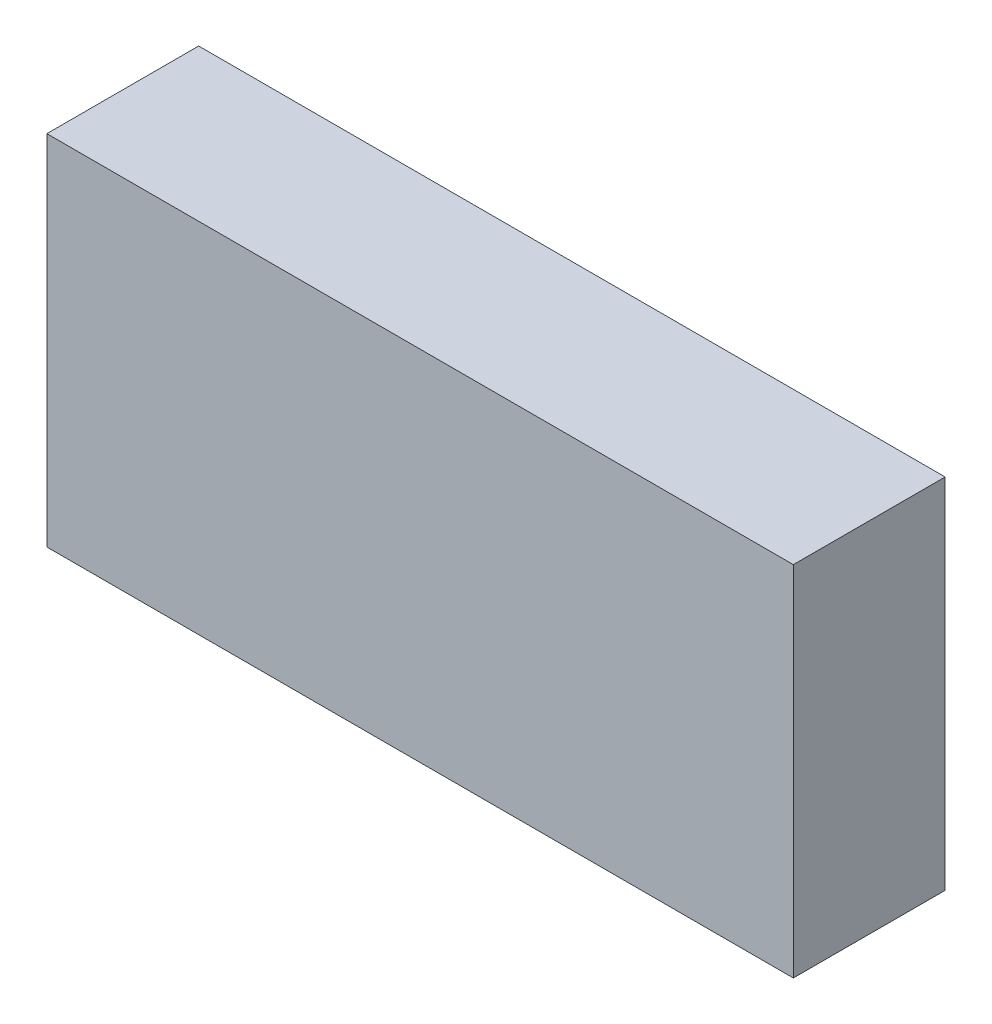
ISO-10303-21;
HEADER;
FILE_DESCRIPTION(('STEP AP214'),'2;1');
FILE_NAME('part.step','',(''),(''),'','','');
FILE_SCHEMA(('AUTOMOTIVE_DESIGN { 1 0 10303 214 1 1 1 1 }'));
ENDSEC;
DATA;
#1=APPLICATION_CONTEXT('core data for automotive mechanical design processes');
#2=APPLICATION_PROTOCOL_DEFINITION('international standard','automotive_design',2000,#1);
#3=PRODUCT_CONTEXT('',#1,'mechanical');
#4=PRODUCT('Part','Part','',(#3));
#5=PRODUCT_RELATED_PRODUCT_CATEGORY('part','',(#4));
#6=PRODUCT_DEFINITION_FORMATION('','',#4);
#7=PRODUCT_DEFINITION_CONTEXT('part definition',#1,'design');
#8=PRODUCT_DEFINITION('design','',#6,#7);
#9=PRODUCT_DEFINITION_SHAPE('','',#8);
#10=(LENGTH_UNIT() NAMED_UNIT(*) SI_UNIT(.MILLI.,.METRE.));
#11=(NAMED_UNIT(*) PLANE_ANGLE_UNIT() SI_UNIT($,.RADIAN.));
#12=(NAMED_UNIT(*) SI_UNIT($,.STERADIAN.) SOLID_ANGLE_UNIT());
#13=UNCERTAINTY_MEASURE_WITH_UNIT(LENGTH_MEASURE(1.E-05),#10,'distance_accuracy_value','');
#14=(GEOMETRIC_REPRESENTATION_CONTEXT(3) GLOBAL_UNCERTAINTY_ASSIGNED_CONTEXT((#13)) GLOBAL_UNIT_ASSIGNED_CONTEXT((#10,
#11,#12)) REPRESENTATION_CONTEXT('',''));
#15=CARTESIAN_POINT('',(0.,0.,0.));
#16=DIRECTION('',(0.,0.,1.));
#17=DIRECTION('',(1.,0.,0.));
#18=AXIS2_PLACEMENT_3D('',#15,#16,#17);
#19=CARTESIAN_POINT('',(-0.62449202,0.2994914,0.));
#20=DIRECTION('',(1.,0.,0.));
#21=DIRECTION('',(0.,-1.,0.));
#22=AXIS2_PLACEMENT_3D('',#19,#20,#21);
#23=PLANE('',#22);
#24=DIRECTION('',(0.,-1.,0.));
#25=VECTOR('',#24,1.);
#26=CARTESIAN_POINT('',(-0.62449202,0.2994914,0.));
#27=LINE('',#26,#25);
#28=CARTESIAN_POINT('',(-0.62449202,0.2994914,0.));
#29=VERTEX_POINT('',#28);
#30=CARTESIAN_POINT('',(-0.62449202,-0.2994914,0.));
#31=VERTEX_POINT('',#30);
#32=EDGE_CURVE('E11',#29,#31,#27,.T.);
#33=ORIENTED_EDGE('',*,*,#32,.T.);
#34=DIRECTION('',(0.,0.,1.));
#35=VECTOR('',#34,1.);
#36=CARTESIAN_POINT('',(-0.62449202,-0.2994914,0.));
#37=LINE('',#36,#35);
#38=CARTESIAN_POINT('',(-0.62449202,-0.2994914,0.254));
#39=VERTEX_POINT('',#38);
#40=EDGE_CURVE('E24',#31,#39,#37,.T.);
#41=ORIENTED_EDGE('',*,*,#40,.T.);
#42=DIRECTION('',(0.,-1.,0.));
#43=VECTOR('',#42,1.);
#44=CARTESIAN_POINT('',(-0.62449202,0.2994914,0.254));
#45=LINE('',#44,#43);
#46=CARTESIAN_POINT('',(-0.62449202,0.2994914,0.254));
#47=VERTEX_POINT('',#46);
#48=EDGE_CURVE('E87',#47,#39,#45,.T.);
#49=ORIENTED_EDGE('',*,*,#48,.F.);
#50=DIRECTION('',(0.,0.,1.));
#51=VECTOR('',#50,1.);
#52=CARTESIAN_POINT('',(-0.62449202,0.2994914,0.));
#53=LINE('',#52,#51);
#54=EDGE_CURVE('E36',#29,#47,#53,.T.);
#55=ORIENTED_EDGE('',*,*,#54,.F.);
#56=EDGE_LOOP('',(#33,#41,#49,#55));
#57=FACE_BOUND('',#56,.T.);
#58=ADVANCED_FACE('F17',(#57),#23,.F.);
#59=CARTESIAN_POINT('',(-0.62449202,-0.2994914,0.));
#60=DIRECTION('',(0.,1.,0.));
#61=DIRECTION('',(1.,0.,0.));
#62=AXIS2_PLACEMENT_3D('',#59,#60,#61);
#63=PLANE('',#62);
#64=DIRECTION('',(1.,0.,0.));
#65=VECTOR('',#64,1.);
#66=CARTESIAN_POINT('',(-0.62449202,-0.2994914,0.));
#67=LINE('',#66,#65);
#68=CARTESIAN_POINT('',(0.62449202,-0.2994914,0.));
#69=VERTEX_POINT('',#68);
#70=EDGE_CURVE('E84',#31,#69,#67,.T.);
#71=ORIENTED_EDGE('',*,*,#70,.T.);
#72=DIRECTION('',(0.,0.,1.));
#73=VECTOR('',#72,1.);
#74=CARTESIAN_POINT('',(0.62449202,-0.2994914,0.));
#75=LINE('',#74,#73);
#76=CARTESIAN_POINT('',(0.62449202,-0.2994914,0.254));
#77=VERTEX_POINT('',#76);
#78=EDGE_CURVE('E82',#69,#77,#75,.T.);
#79=ORIENTED_EDGE('',*,*,#78,.T.);
#80=DIRECTION('',(1.,0.,0.));
#81=VECTOR('',#80,1.);
#82=CARTESIAN_POINT('',(-0.62449202,-0.2994914,0.254));
#83=LINE('',#82,#81);
#84=EDGE_CURVE('E62',#39,#77,#83,.T.);
#85=ORIENTED_EDGE('',*,*,#84,.F.);
#86=ORIENTED_EDGE('',*,*,#40,.F.);
#87=EDGE_LOOP('',(#71,#79,#85,#86));
#88=FACE_BOUND('',#87,.T.);
#89=ADVANCED_FACE('F89',(#88),#63,.F.);
#90=CARTESIAN_POINT('',(0.62449202,-0.2994914,0.));
#91=DIRECTION('',(-1.,0.,0.));
#92=DIRECTION('',(0.,1.,0.));
#93=AXIS2_PLACEMENT_3D('',#90,#91,#92);
#94=PLANE('',#93);
#95=DIRECTION('',(0.,1.,0.));
#96=VECTOR('',#95,1.);
#97=CARTESIAN_POINT('',(0.62449202,-0.2994914,0.));
#98=LINE('',#97,#96);
#99=CARTESIAN_POINT('',(0.62449202,0.2994914,0.));
#100=VERTEX_POINT('',#99);
#101=EDGE_CURVE('E71',#69,#100,#98,.T.);
#102=ORIENTED_EDGE('',*,*,#101,.T.);
#103=DIRECTION('',(0.,0.,1.));
#104=VECTOR('',#103,1.);
#105=CARTESIAN_POINT('',(0.62449202,0.2994914,0.));
#106=LINE('',#105,#104);
#107=CARTESIAN_POINT('',(0.62449202,0.2994914,0.254));
#108=VERTEX_POINT('',#107);
#109=EDGE_CURVE('E65',#100,#108,#106,.T.);
#110=ORIENTED_EDGE('',*,*,#109,.T.);
#111=DIRECTION('',(0.,1.,0.));
#112=VECTOR('',#111,1.);
#113=CARTESIAN_POINT('',(0.62449202,-0.2994914,0.254));
#114=LINE('',#113,#112);
#115=EDGE_CURVE('E57',#77,#108,#114,.T.);
#116=ORIENTED_EDGE('',*,*,#115,.F.);
#117=ORIENTED_EDGE('',*,*,#78,.F.);
#118=EDGE_LOOP('',(#102,#110,#116,#117));
#119=FACE_BOUND('',#118,.T.);
#120=ADVANCED_FACE('F69',(#119),#94,.F.);
#121=CARTESIAN_POINT('',(0.62449202,0.2994914,0.));
#122=DIRECTION('',(0.,-1.,0.));
#123=DIRECTION('',(-1.,0.,0.));
#124=AXIS2_PLACEMENT_3D('',#121,#122,#123);
#125=PLANE('',#124);
#126=DIRECTION('',(-1.,0.,0.));
#127=VECTOR('',#126,1.);
#128=CARTESIAN_POINT('',(0.62449202,0.2994914,0.));
#129=LINE('',#128,#127);
#130=EDGE_CURVE('E66',#100,#29,#129,.T.);
#131=ORIENTED_EDGE('',*,*,#130,.T.);
#132=ORIENTED_EDGE('',*,*,#54,.T.);
#133=DIRECTION('',(-1.,0.,0.));
#134=VECTOR('',#133,1.);
#135=CARTESIAN_POINT('',(0.62449202,0.2994914,0.254));
#136=LINE('',#135,#134);
#137=EDGE_CURVE('E61',#108,#47,#136,.T.);
#138=ORIENTED_EDGE('',*,*,#137,.F.);
#139=ORIENTED_EDGE('',*,*,#109,.F.);
#140=EDGE_LOOP('',(#131,#132,#138,#139));
#141=FACE_BOUND('',#140,.T.);
#142=ADVANCED_FACE('F76',(#141),#125,.F.);
#143=CARTESIAN_POINT('',(-0.62449202,0.2994914,0.));
#144=DIRECTION('',(0.,0.,-1.));
#145=DIRECTION('',(-1.,0.,0.));
#146=AXIS2_PLACEMENT_3D('',#143,#144,#145);
#147=PLANE('',#146);
#148=ORIENTED_EDGE('',*,*,#130,.F.);
#149=ORIENTED_EDGE('',*,*,#101,.F.);
#150=ORIENTED_EDGE('',*,*,#70,.F.);
#151=ORIENTED_EDGE('',*,*,#32,.F.);
#152=EDGE_LOOP('',(#148,#149,#150,#151));
#153=FACE_BOUND('',#152,.T.);
#154=ADVANCED_FACE('F91',(#153),#147,.T.);
#155=CARTESIAN_POINT('',(-0.62449202,0.2994914,0.254));
#156=DIRECTION('',(0.,0.,-1.));
#157=DIRECTION('',(-1.,0.,0.));
#158=AXIS2_PLACEMENT_3D('',#155,#156,#157);
#159=PLANE('',#158);
#160=ORIENTED_EDGE('',*,*,#48,.T.);
#161=ORIENTED_EDGE('',*,*,#84,.T.);
#162=ORIENTED_EDGE('',*,*,#115,.T.);
#163=ORIENTED_EDGE('',*,*,#137,.T.);
#164=EDGE_LOOP('',(#160,#161,#162,#163));
#165=FACE_BOUND('',#164,.T.);
#166=ADVANCED_FACE('F59',(#165),#159,.F.);
#167=CLOSED_SHELL('',(#58,#89,#120,#142,#154,#166));
#168=MANIFOLD_SOLID_BREP('B1',#167);
#169=ADVANCED_BREP_SHAPE_REPRESENTATION('',(#18,#168),#14);
#170=SHAPE_DEFINITION_REPRESENTATION(#9,#169);
ENDSEC;
END-ISO-10303-21;
